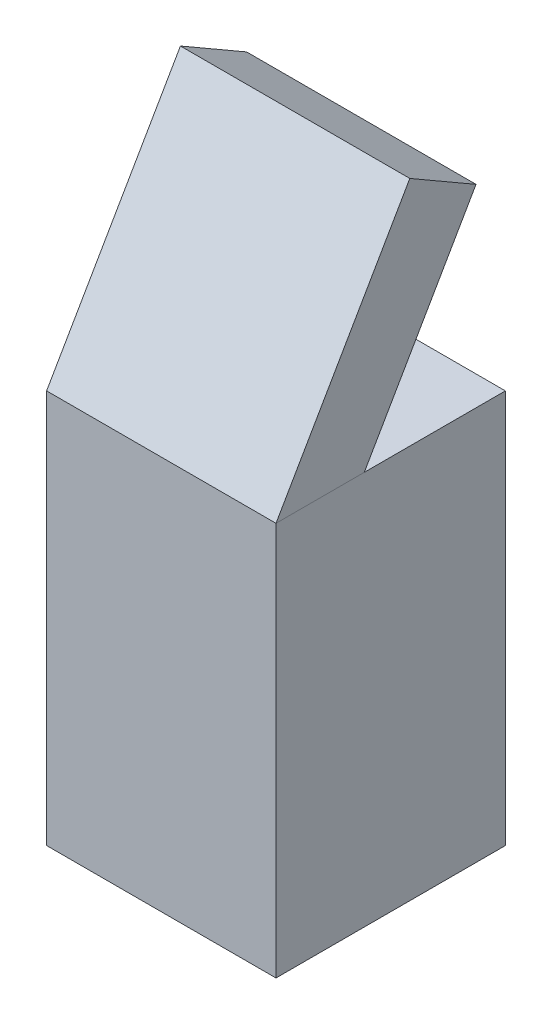
ISO-10303-21;
HEADER;
FILE_DESCRIPTION(('STEP AP214'),'2;1');
FILE_NAME('part.step','',(''),(''),'','','');
FILE_SCHEMA(('AUTOMOTIVE_DESIGN { 1 0 10303 214 1 1 1 1 }'));
ENDSEC;
DATA;
#1=APPLICATION_CONTEXT('core data for automotive mechanical design processes');
#2=APPLICATION_PROTOCOL_DEFINITION('international standard','automotive_design',2000,#1);
#3=PRODUCT_CONTEXT('',#1,'mechanical');
#4=PRODUCT('Part','Part','',(#3));
#5=PRODUCT_RELATED_PRODUCT_CATEGORY('part','',(#4));
#6=PRODUCT_DEFINITION_FORMATION('','',#4);
#7=PRODUCT_DEFINITION_CONTEXT('part definition',#1,'design');
#8=PRODUCT_DEFINITION('design','',#6,#7);
#9=PRODUCT_DEFINITION_SHAPE('','',#8);
#10=(LENGTH_UNIT() NAMED_UNIT(*) SI_UNIT(.MILLI.,.METRE.));
#11=(NAMED_UNIT(*) PLANE_ANGLE_UNIT() SI_UNIT($,.RADIAN.));
#12=(NAMED_UNIT(*) SI_UNIT($,.STERADIAN.) SOLID_ANGLE_UNIT());
#13=UNCERTAINTY_MEASURE_WITH_UNIT(LENGTH_MEASURE(1.E-05),#10,'distance_accuracy_value','');
#14=(GEOMETRIC_REPRESENTATION_CONTEXT(3) GLOBAL_UNCERTAINTY_ASSIGNED_CONTEXT((#13)) GLOBAL_UNIT_ASSIGNED_CONTEXT((#10,
#11,#12)) REPRESENTATION_CONTEXT('',''));
#15=CARTESIAN_POINT('',(0.,0.,0.));
#16=DIRECTION('',(0.,0.,1.));
#17=DIRECTION('',(1.,0.,0.));
#18=AXIS2_PLACEMENT_3D('',#15,#16,#17);
#19=CARTESIAN_POINT('',(-300.,1030.,69.0598923241498));
#20=DIRECTION('',(0.,-1.,0.));
#21=DIRECTION('',(0.,0.,-1.));
#22=AXIS2_PLACEMENT_3D('',#19,#20,#21);
#23=PLANE('',#22);
#24=DIRECTION('',(0.,0.,-1.));
#25=VECTOR('',#24,1.);
#26=CARTESIAN_POINT('',(300.,1030.,69.0598923241498));
#27=LINE('',#26,#25);
#28=CARTESIAN_POINT('',(300.,1030.,300.));
#29=VERTEX_POINT('',#28);
#30=CARTESIAN_POINT('',(300.,1030.,69.0598923241498));
#31=VERTEX_POINT('',#30);
#32=EDGE_CURVE('E105',#29,#31,#27,.T.);
#33=ORIENTED_EDGE('',*,*,#32,.F.);
#34=DIRECTION('',(1.,0.,0.));
#35=VECTOR('',#34,1.);
#36=CARTESIAN_POINT('',(-300.,1030.,300.));
#37=LINE('',#36,#35);
#38=CARTESIAN_POINT('',(-300.,1030.,300.));
#39=VERTEX_POINT('',#38);
#40=EDGE_CURVE('E12',#39,#29,#37,.T.);
#41=ORIENTED_EDGE('',*,*,#40,.F.);
#42=DIRECTION('',(0.,0.,-1.));
#43=VECTOR('',#42,1.);
#44=CARTESIAN_POINT('',(-300.,1030.,69.0598923241498));
#45=LINE('',#44,#43);
#46=CARTESIAN_POINT('',(-300.,1030.,69.0598923241498));
#47=VERTEX_POINT('',#46);
#48=EDGE_CURVE('E99',#39,#47,#45,.T.);
#49=ORIENTED_EDGE('',*,*,#48,.T.);
#50=DIRECTION('',(1.,0.,0.));
#51=VECTOR('',#50,1.);
#52=CARTESIAN_POINT('',(-300.,1030.,69.0598923241498));
#53=LINE('',#52,#51);
#54=EDGE_CURVE('E44',#47,#31,#53,.T.);
#55=ORIENTED_EDGE('',*,*,#54,.T.);
#56=EDGE_LOOP('',(#33,#41,#49,#55));
#57=FACE_BOUND('',#56,.T.);
#58=ADVANCED_FACE('F41',(#57),#23,.T.);
#59=CARTESIAN_POINT('',(-300.,1030.,300.));
#60=DIRECTION('',(0.,0.499999999999998,0.86602540378444));
#61=DIRECTION('',(0.,-0.86602540378444,0.499999999999998));
#62=AXIS2_PLACEMENT_3D('',#59,#60,#61);
#63=PLANE('',#62);
#64=DIRECTION('',(0.,-0.86602540378444,0.499999999999998));
#65=VECTOR('',#64,1.);
#66=CARTESIAN_POINT('',(300.,1030.,300.));
#67=LINE('',#66,#65);
#68=CARTESIAN_POINT('',(300.,1636.21778264911,-49.9999999999984));
#69=VERTEX_POINT('',#68);
#70=EDGE_CURVE('E101',#69,#29,#67,.T.);
#71=ORIENTED_EDGE('',*,*,#70,.F.);
#72=DIRECTION('',(1.,0.,0.));
#73=VECTOR('',#72,1.);
#74=CARTESIAN_POINT('',(-300.,1636.21778264911,-49.9999999999984));
#75=LINE('',#74,#73);
#76=CARTESIAN_POINT('',(-300.,1636.21778264911,-49.9999999999984));
#77=VERTEX_POINT('',#76);
#78=EDGE_CURVE('E50',#77,#69,#75,.T.);
#79=ORIENTED_EDGE('',*,*,#78,.F.);
#80=DIRECTION('',(0.,-0.86602540378444,0.499999999999998));
#81=VECTOR('',#80,1.);
#82=CARTESIAN_POINT('',(-300.,1030.,300.));
#83=LINE('',#82,#81);
#84=EDGE_CURVE('E96',#77,#39,#83,.T.);
#85=ORIENTED_EDGE('',*,*,#84,.T.);
#86=ORIENTED_EDGE('',*,*,#40,.T.);
#87=EDGE_LOOP('',(#71,#79,#85,#86));
#88=FACE_BOUND('',#87,.T.);
#89=ADVANCED_FACE('F115',(#88),#63,.T.);
#90=CARTESIAN_POINT('',(-300.,1636.21778264911,-49.9999999999984));
#91=DIRECTION('',(0.,0.866025403784438,-0.5));
#92=DIRECTION('',(0.,0.5,0.866025403784439));
#93=AXIS2_PLACEMENT_3D('',#90,#91,#92);
#94=PLANE('',#93);
#95=DIRECTION('',(0.,0.5,0.866025403784439));
#96=VECTOR('',#95,1.);
#97=CARTESIAN_POINT('',(300.,1636.21778264911,-49.9999999999984));
#98=LINE('',#97,#96);
#99=CARTESIAN_POINT('',(300.,1536.21778264911,-223.205080756888));
#100=VERTEX_POINT('',#99);
#101=EDGE_CURVE('E91',#100,#69,#98,.T.);
#102=ORIENTED_EDGE('',*,*,#101,.F.);
#103=DIRECTION('',(1.,0.,0.));
#104=VECTOR('',#103,1.);
#105=CARTESIAN_POINT('',(-300.,1536.21778264911,-223.205080756888));
#106=LINE('',#105,#104);
#107=CARTESIAN_POINT('',(-300.,1536.21778264911,-223.205080756888));
#108=VERTEX_POINT('',#107);
#109=EDGE_CURVE('E86',#108,#100,#106,.T.);
#110=ORIENTED_EDGE('',*,*,#109,.F.);
#111=DIRECTION('',(0.,0.5,0.866025403784439));
#112=VECTOR('',#111,1.);
#113=CARTESIAN_POINT('',(-300.,1636.21778264911,-49.9999999999984));
#114=LINE('',#113,#112);
#115=EDGE_CURVE('E89',#108,#77,#114,.T.);
#116=ORIENTED_EDGE('',*,*,#115,.T.);
#117=ORIENTED_EDGE('',*,*,#78,.T.);
#118=EDGE_LOOP('',(#102,#110,#116,#117));
#119=FACE_BOUND('',#118,.T.);
#120=ADVANCED_FACE('F88',(#119),#94,.T.);
#121=CARTESIAN_POINT('',(-300.,1536.21778264911,-223.205080756888));
#122=DIRECTION('',(0.,-0.5,-0.866025403784438));
#123=DIRECTION('',(0.,0.866025403784439,-0.5));
#124=AXIS2_PLACEMENT_3D('',#121,#122,#123);
#125=PLANE('',#124);
#126=DIRECTION('',(0.,0.866025403784439,-0.5));
#127=VECTOR('',#126,1.);
#128=CARTESIAN_POINT('',(300.,1536.21778264911,-223.205080756888));
#129=LINE('',#128,#127);
#130=EDGE_CURVE('E108',#31,#100,#129,.T.);
#131=ORIENTED_EDGE('',*,*,#130,.F.);
#132=ORIENTED_EDGE('',*,*,#54,.F.);
#133=DIRECTION('',(0.,0.866025403784439,-0.5));
#134=VECTOR('',#133,1.);
#135=CARTESIAN_POINT('',(-300.,1536.21778264911,-223.205080756888));
#136=LINE('',#135,#134);
#137=EDGE_CURVE('E95',#47,#108,#136,.T.);
#138=ORIENTED_EDGE('',*,*,#137,.T.);
#139=ORIENTED_EDGE('',*,*,#109,.T.);
#140=EDGE_LOOP('',(#131,#132,#138,#139));
#141=FACE_BOUND('',#140,.T.);
#142=ADVANCED_FACE('F98',(#141),#125,.T.);
#143=CARTESIAN_POINT('',(-300.,1030.,300.));
#144=DIRECTION('',(-1.,0.,0.));
#145=DIRECTION('',(0.,0.,1.));
#146=AXIS2_PLACEMENT_3D('',#143,#144,#145);
#147=PLANE('',#146);
#148=ORIENTED_EDGE('',*,*,#48,.F.);
#149=ORIENTED_EDGE('',*,*,#84,.F.);
#150=ORIENTED_EDGE('',*,*,#115,.F.);
#151=ORIENTED_EDGE('',*,*,#137,.F.);
#152=EDGE_LOOP('',(#148,#149,#150,#151));
#153=FACE_BOUND('',#152,.T.);
#154=ADVANCED_FACE('F94',(#153),#147,.T.);
#155=CARTESIAN_POINT('',(300.,1030.,300.));
#156=DIRECTION('',(-1.,0.,0.));
#157=DIRECTION('',(0.,0.,1.));
#158=AXIS2_PLACEMENT_3D('',#155,#156,#157);
#159=PLANE('',#158);
#160=ORIENTED_EDGE('',*,*,#32,.T.);
#161=ORIENTED_EDGE('',*,*,#130,.T.);
#162=ORIENTED_EDGE('',*,*,#101,.T.);
#163=ORIENTED_EDGE('',*,*,#70,.T.);
#164=EDGE_LOOP('',(#160,#161,#162,#163));
#165=FACE_BOUND('',#164,.T.);
#166=ADVANCED_FACE('F114',(#165),#159,.F.);
#167=CLOSED_SHELL('',(#58,#89,#120,#142,#154,#166));
#168=MANIFOLD_SOLID_BREP('B2',#167);
#169=CARTESIAN_POINT('',(300.,1030.,-300.));
#170=DIRECTION('',(-1.,0.,0.));
#171=DIRECTION('',(0.,0.,1.));
#172=AXIS2_PLACEMENT_3D('',#169,#170,#171);
#173=PLANE('',#172);
#174=DIRECTION('',(0.,0.,-1.));
#175=VECTOR('',#174,1.);
#176=CARTESIAN_POINT('',(300.,0.,-300.));
#177=LINE('',#176,#175);
#178=CARTESIAN_POINT('',(300.,0.,300.));
#179=VERTEX_POINT('',#178);
#180=CARTESIAN_POINT('',(300.,0.,-300.));
#181=VERTEX_POINT('',#180);
#182=EDGE_CURVE('E228',#179,#181,#177,.T.);
#183=ORIENTED_EDGE('',*,*,#182,.T.);
#184=DIRECTION('',(0.,-1.,0.));
#185=VECTOR('',#184,1.);
#186=CARTESIAN_POINT('',(300.,1030.,-300.));
#187=LINE('',#186,#185);
#188=CARTESIAN_POINT('',(300.,1030.,-300.));
#189=VERTEX_POINT('',#188);
#190=EDGE_CURVE('E39',#189,#181,#187,.T.);
#191=ORIENTED_EDGE('',*,*,#190,.F.);
#192=DIRECTION('',(0.,0.,-1.));
#193=VECTOR('',#192,1.);
#194=CARTESIAN_POINT('',(300.,1030.,-300.));
#195=LINE('',#194,#193);
#196=CARTESIAN_POINT('',(300.,1030.,300.));
#197=VERTEX_POINT('',#196);
#198=EDGE_CURVE('E216',#197,#189,#195,.T.);
#199=ORIENTED_EDGE('',*,*,#198,.F.);
#200=DIRECTION('',(0.,-1.,0.));
#201=VECTOR('',#200,1.);
#202=CARTESIAN_POINT('',(300.,1030.,300.));
#203=LINE('',#202,#201);
#204=EDGE_CURVE('E224',#197,#179,#203,.T.);
#205=ORIENTED_EDGE('',*,*,#204,.T.);
#206=EDGE_LOOP('',(#183,#191,#199,#205));
#207=FACE_BOUND('',#206,.T.);
#208=ADVANCED_FACE('F165',(#207),#173,.F.);
#209=CARTESIAN_POINT('',(-300.,1030.,-300.));
#210=DIRECTION('',(0.,0.,1.));
#211=DIRECTION('',(1.,0.,0.));
#212=AXIS2_PLACEMENT_3D('',#209,#210,#211);
#213=PLANE('',#212);
#214=DIRECTION('',(-1.,0.,0.));
#215=VECTOR('',#214,1.);
#216=CARTESIAN_POINT('',(-300.,0.,-300.));
#217=LINE('',#216,#215);
#218=CARTESIAN_POINT('',(-300.,0.,-300.));
#219=VERTEX_POINT('',#218);
#220=EDGE_CURVE('E220',#181,#219,#217,.T.);
#221=ORIENTED_EDGE('',*,*,#220,.T.);
#222=DIRECTION('',(0.,-1.,0.));
#223=VECTOR('',#222,1.);
#224=CARTESIAN_POINT('',(-300.,1030.,-300.));
#225=LINE('',#224,#223);
#226=CARTESIAN_POINT('',(-300.,1030.,-300.));
#227=VERTEX_POINT('',#226);
#228=EDGE_CURVE('E173',#227,#219,#225,.T.);
#229=ORIENTED_EDGE('',*,*,#228,.F.);
#230=DIRECTION('',(-1.,0.,0.));
#231=VECTOR('',#230,1.);
#232=CARTESIAN_POINT('',(-300.,1030.,-300.));
#233=LINE('',#232,#231);
#234=EDGE_CURVE('E211',#189,#227,#233,.T.);
#235=ORIENTED_EDGE('',*,*,#234,.F.);
#236=ORIENTED_EDGE('',*,*,#190,.T.);
#237=EDGE_LOOP('',(#221,#229,#235,#236));
#238=FACE_BOUND('',#237,.T.);
#239=ADVANCED_FACE('F219',(#238),#213,.F.);
#240=CARTESIAN_POINT('',(-300.,1030.,-300.));
#241=DIRECTION('',(1.,0.,0.));
#242=DIRECTION('',(0.,0.,-1.));
#243=AXIS2_PLACEMENT_3D('',#240,#241,#242);
#244=PLANE('',#243);
#245=DIRECTION('',(0.,0.,1.));
#246=VECTOR('',#245,1.);
#247=CARTESIAN_POINT('',(-300.,0.,-300.));
#248=LINE('',#247,#246);
#249=CARTESIAN_POINT('',(-300.,0.,300.));
#250=VERTEX_POINT('',#249);
#251=EDGE_CURVE('E198',#219,#250,#248,.T.);
#252=ORIENTED_EDGE('',*,*,#251,.T.);
#253=DIRECTION('',(0.,-1.,0.));
#254=VECTOR('',#253,1.);
#255=CARTESIAN_POINT('',(-300.,1030.,300.));
#256=LINE('',#255,#254);
#257=CARTESIAN_POINT('',(-300.,1030.,300.));
#258=VERTEX_POINT('',#257);
#259=EDGE_CURVE('E221',#258,#250,#256,.T.);
#260=ORIENTED_EDGE('',*,*,#259,.F.);
#261=DIRECTION('',(0.,0.,1.));
#262=VECTOR('',#261,1.);
#263=CARTESIAN_POINT('',(-300.,1030.,-300.));
#264=LINE('',#263,#262);
#265=EDGE_CURVE('E214',#227,#258,#264,.T.);
#266=ORIENTED_EDGE('',*,*,#265,.F.);
#267=ORIENTED_EDGE('',*,*,#228,.T.);
#268=EDGE_LOOP('',(#252,#260,#266,#267));
#269=FACE_BOUND('',#268,.T.);
#270=ADVANCED_FACE('F222',(#269),#244,.F.);
#271=CARTESIAN_POINT('',(-300.,1030.,300.));
#272=DIRECTION('',(0.,0.,-1.));
#273=DIRECTION('',(-1.,0.,0.));
#274=AXIS2_PLACEMENT_3D('',#271,#272,#273);
#275=PLANE('',#274);
#276=DIRECTION('',(1.,0.,0.));
#277=VECTOR('',#276,1.);
#278=CARTESIAN_POINT('',(-300.,0.,300.));
#279=LINE('',#278,#277);
#280=EDGE_CURVE('E204',#250,#179,#279,.T.);
#281=ORIENTED_EDGE('',*,*,#280,.T.);
#282=ORIENTED_EDGE('',*,*,#204,.F.);
#283=DIRECTION('',(1.,0.,0.));
#284=VECTOR('',#283,1.);
#285=CARTESIAN_POINT('',(-300.,1030.,300.));
#286=LINE('',#285,#284);
#287=EDGE_CURVE('E181',#258,#197,#286,.T.);
#288=ORIENTED_EDGE('',*,*,#287,.F.);
#289=ORIENTED_EDGE('',*,*,#259,.T.);
#290=EDGE_LOOP('',(#281,#282,#288,#289));
#291=FACE_BOUND('',#290,.T.);
#292=ADVANCED_FACE('F235',(#291),#275,.F.);
#293=CARTESIAN_POINT('',(300.,1030.,300.));
#294=DIRECTION('',(0.,1.,0.));
#295=DIRECTION('',(0.,0.,1.));
#296=AXIS2_PLACEMENT_3D('',#293,#294,#295);
#297=PLANE('',#296);
#298=ORIENTED_EDGE('',*,*,#198,.T.);
#299=ORIENTED_EDGE('',*,*,#234,.T.);
#300=ORIENTED_EDGE('',*,*,#265,.T.);
#301=ORIENTED_EDGE('',*,*,#287,.T.);
#302=EDGE_LOOP('',(#298,#299,#300,#301));
#303=FACE_BOUND('',#302,.T.);
#304=ADVANCED_FACE('F212',(#303),#297,.T.);
#305=CARTESIAN_POINT('',(300.,0.,300.));
#306=DIRECTION('',(0.,1.,0.));
#307=DIRECTION('',(0.,0.,1.));
#308=AXIS2_PLACEMENT_3D('',#305,#306,#307);
#309=PLANE('',#308);
#310=ORIENTED_EDGE('',*,*,#182,.F.);
#311=ORIENTED_EDGE('',*,*,#280,.F.);
#312=ORIENTED_EDGE('',*,*,#251,.F.);
#313=ORIENTED_EDGE('',*,*,#220,.F.);
#314=EDGE_LOOP('',(#310,#311,#312,#313));
#315=FACE_BOUND('',#314,.T.);
#316=ADVANCED_FACE('F238',(#315),#309,.F.);
#317=CLOSED_SHELL('',(#208,#239,#270,#292,#304,#316));
#318=MANIFOLD_SOLID_BREP('B6',#317);
#319=ADVANCED_BREP_SHAPE_REPRESENTATION('',(#18,#168,#318),#14);
#320=SHAPE_DEFINITION_REPRESENTATION(#9,#319);
ENDSEC;
END-ISO-10303-21;
